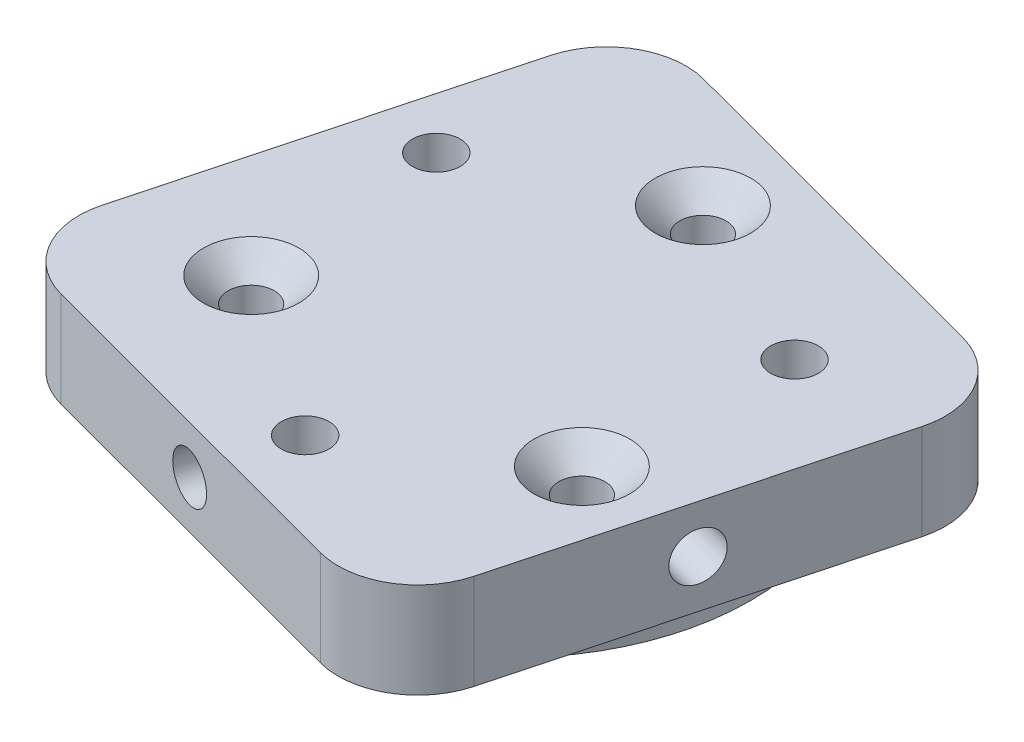
ISO-10303-21;
HEADER;
FILE_DESCRIPTION(('STEP AP214'),'2;1');
FILE_NAME('part.step','',(''),(''),'','','');
FILE_SCHEMA(('AUTOMOTIVE_DESIGN { 1 0 10303 214 1 1 1 1 }'));
ENDSEC;
DATA;
#1=APPLICATION_CONTEXT('core data for automotive mechanical design processes');
#2=APPLICATION_PROTOCOL_DEFINITION('international standard','automotive_design',2000,#1);
#3=PRODUCT_CONTEXT('',#1,'mechanical');
#4=PRODUCT('Part','Part','',(#3));
#5=PRODUCT_RELATED_PRODUCT_CATEGORY('part','',(#4));
#6=PRODUCT_DEFINITION_FORMATION('','',#4);
#7=PRODUCT_DEFINITION_CONTEXT('part definition',#1,'design');
#8=PRODUCT_DEFINITION('design','',#6,#7);
#9=PRODUCT_DEFINITION_SHAPE('','',#8);
#10=(LENGTH_UNIT() NAMED_UNIT(*) SI_UNIT(.MILLI.,.METRE.));
#11=(NAMED_UNIT(*) PLANE_ANGLE_UNIT() SI_UNIT($,.RADIAN.));
#12=(NAMED_UNIT(*) SI_UNIT($,.STERADIAN.) SOLID_ANGLE_UNIT());
#13=UNCERTAINTY_MEASURE_WITH_UNIT(LENGTH_MEASURE(1.E-05),#10,'distance_accuracy_value','');
#14=(GEOMETRIC_REPRESENTATION_CONTEXT(3) GLOBAL_UNCERTAINTY_ASSIGNED_CONTEXT((#13)) GLOBAL_UNIT_ASSIGNED_CONTEXT((#10,
#11,#12)) REPRESENTATION_CONTEXT('',''));
#15=CARTESIAN_POINT('',(0.,0.,0.));
#16=DIRECTION('',(0.,0.,1.));
#17=DIRECTION('',(1.,0.,0.));
#18=AXIS2_PLACEMENT_3D('',#15,#16,#17);
#19=CARTESIAN_POINT('',(22.5578744114501,5.,6.01617480152647));
#20=DIRECTION('',(-0.966227030545209,0.,-0.257692307692308));
#21=DIRECTION('',(-0.257692307692308,0.,0.96622703054521));
#22=AXIS2_PLACEMENT_3D('',#19,#20,#21);
#23=CYLINDRICAL_SURFACE('',#22,1.5);
#24=CARTESIAN_POINT('',(-15.942746003996,5.,-4.25192307692308));
#25=DIRECTION('',(-0.966227030545209,0.,-0.257692307692308));
#26=DIRECTION('',(-0.257692307692308,0.,0.966227030545209));
#27=AXIS2_PLACEMENT_3D('',#24,#25,#26);
#28=CIRCLE('',#27,1.5);
#29=CARTESIAN_POINT('',(-16.3292844655344,5.,-2.80258253110526));
#30=VERTEX_POINT('',#29);
#31=EDGE_CURVE('E233',#30,#30,#28,.T.);
#32=ORIENTED_EDGE('',*,*,#31,.T.);
#33=EDGE_LOOP('',(#32));
#34=FACE_BOUND('',#33,.T.);
#35=CARTESIAN_POINT('',(-0.0891901874349355,5.,-0.0237869822485182));
#36=DIRECTION('',(-0.8654416636931,0.,0.501009707235418));
#37=DIRECTION('',(-0.501009707235418,0.,-0.8654416636931));
#38=AXIS2_PLACEMENT_3D('',#35,#36,#37);
#39=ELLIPSE('',#38,2.12132034355964,1.5);
#40=CARTESIAN_POINT('',(-0.0891901874349355,3.5,-0.0237869822485182));
#41=VERTEX_POINT('',#40);
#42=CARTESIAN_POINT('',(-0.0891901874349355,6.5,-0.0237869822485182));
#43=VERTEX_POINT('',#42);
#44=EDGE_CURVE('E50',#41,#43,#39,.F.);
#45=ORIENTED_EDGE('',*,*,#44,.T.);
#46=CARTESIAN_POINT('',(-0.0891901874349355,5.,-0.0237869822485182));
#47=DIRECTION('',(-0.501009707235418,0.,-0.8654416636931));
#48=DIRECTION('',(-0.8654416636931,0.,0.501009707235418));
#49=AXIS2_PLACEMENT_3D('',#46,#47,#48);
#50=ELLIPSE('',#49,2.12132034355964,1.5);
#51=EDGE_CURVE('E11',#43,#41,#50,.F.);
#52=ORIENTED_EDGE('',*,*,#51,.T.);
#53=EDGE_LOOP('',(#45,#52));
#54=FACE_BOUND('',#53,.T.);
#55=ADVANCED_FACE('F36',(#34,#54),#23,.F.);
#56=CARTESIAN_POINT('',(0.,8.,0.));
#57=DIRECTION('',(0.,1.,0.));
#58=DIRECTION('',(0.,0.,1.));
#59=AXIS2_PLACEMENT_3D('',#56,#57,#58);
#60=PLANE('',#59);
#61=CARTESIAN_POINT('',(10.3923048454132,8.,6.00000000000005));
#62=DIRECTION('',(0.,1.,0.));
#63=DIRECTION('',(0.,0.,1.));
#64=AXIS2_PLACEMENT_3D('',#61,#62,#63);
#65=CIRCLE('',#64,3.00000000000001);
#66=CARTESIAN_POINT('',(10.3923048454132,8.,9.00000000000006));
#67=VERTEX_POINT('',#66);
#68=EDGE_CURVE('E222',#67,#67,#65,.F.);
#69=ORIENTED_EDGE('',*,*,#68,.T.);
#70=EDGE_LOOP('',(#69));
#71=FACE_BOUND('',#70,.T.);
#72=CARTESIAN_POINT('',(-10.3923048454133,8.,5.99999999999998));
#73=DIRECTION('',(0.,1.,0.));
#74=DIRECTION('',(0.,0.,1.));
#75=AXIS2_PLACEMENT_3D('',#72,#73,#74);
#76=CIRCLE('',#75,3.00000000000001);
#77=CARTESIAN_POINT('',(-10.3923048454133,8.,8.99999999999998));
#78=VERTEX_POINT('',#77);
#79=EDGE_CURVE('E219',#78,#78,#76,.F.);
#80=ORIENTED_EDGE('',*,*,#79,.T.);
#81=EDGE_LOOP('',(#80));
#82=FACE_BOUND('',#81,.T.);
#83=CARTESIAN_POINT('',(0.,8.,-12.));
#84=DIRECTION('',(0.,1.,0.));
#85=DIRECTION('',(0.,0.,1.));
#86=AXIS2_PLACEMENT_3D('',#83,#84,#85);
#87=CIRCLE('',#86,3.00000000000001);
#88=CARTESIAN_POINT('',(0.,8.,-8.99999999999999));
#89=VERTEX_POINT('',#88);
#90=EDGE_CURVE('E216',#89,#89,#87,.F.);
#91=ORIENTED_EDGE('',*,*,#90,.T.);
#92=EDGE_LOOP('',(#91));
#93=FACE_BOUND('',#92,.T.);
#94=CARTESIAN_POINT('',(0.,8.,13.));
#95=DIRECTION('',(0.,1.,0.));
#96=DIRECTION('',(0.,0.,1.));
#97=AXIS2_PLACEMENT_3D('',#94,#95,#96);
#98=CIRCLE('',#97,1.5);
#99=CARTESIAN_POINT('',(0.,8.,14.5));
#100=VERTEX_POINT('',#99);
#101=EDGE_CURVE('E190',#100,#100,#98,.T.);
#102=ORIENTED_EDGE('',*,*,#101,.F.);
#103=EDGE_LOOP('',(#102));
#104=FACE_BOUND('',#103,.T.);
#105=CARTESIAN_POINT('',(-11.2583302491977,8.,-6.49999999999997));
#106=DIRECTION('',(0.,1.,0.));
#107=DIRECTION('',(0.,0.,1.));
#108=AXIS2_PLACEMENT_3D('',#105,#106,#107);
#109=CIRCLE('',#108,1.5);
#110=CARTESIAN_POINT('',(-11.2583302491977,8.,-4.99999999999997));
#111=VERTEX_POINT('',#110);
#112=EDGE_CURVE('E196',#111,#111,#109,.T.);
#113=ORIENTED_EDGE('',*,*,#112,.F.);
#114=EDGE_LOOP('',(#113));
#115=FACE_BOUND('',#114,.T.);
#116=CARTESIAN_POINT('',(11.2583302491977,8.,-6.50000000000005));
#117=DIRECTION('',(0.,1.,0.));
#118=DIRECTION('',(0.,0.,1.));
#119=AXIS2_PLACEMENT_3D('',#116,#117,#118);
#120=CIRCLE('',#119,1.5);
#121=CARTESIAN_POINT('',(11.2583302491977,8.,-5.00000000000005));
#122=VERTEX_POINT('',#121);
#123=EDGE_CURVE('E184',#122,#122,#120,.T.);
#124=ORIENTED_EDGE('',*,*,#123,.F.);
#125=EDGE_LOOP('',(#124));
#126=FACE_BOUND('',#125,.T.);
#127=CARTESIAN_POINT('',(8.14814931280838,8.,14.0750723897315));
#128=DIRECTION('',(0.,1.,0.));
#129=DIRECTION('',(0.,0.,-1.));
#130=AXIS2_PLACEMENT_3D('',#127,#128,#129);
#131=CIRCLE('',#130,4.99999999999999);
#132=CARTESIAN_POINT('',(6.85968777434683,8.,18.9062075424575));
#133=VERTEX_POINT('',#132);
#134=CARTESIAN_POINT('',(12.9792844655344,8.,15.363533928193));
#135=VERTEX_POINT('',#134);
#136=EDGE_CURVE('E147',#133,#135,#131,.T.);
#137=ORIENTED_EDGE('',*,*,#136,.T.);
#138=DIRECTION('',(0.257692307692308,0.,-0.966227030545209));
#139=VECTOR('',#138,1.);
#140=CARTESIAN_POINT('',(18.9062075424575,8.,-6.85968777434685));
#141=LINE('',#140,#139);
#142=CARTESIAN_POINT('',(18.9062075424575,8.,-6.85968777434685));
#143=VERTEX_POINT('',#142);
#144=EDGE_CURVE('E150',#135,#143,#141,.T.);
#145=ORIENTED_EDGE('',*,*,#144,.T.);
#146=CARTESIAN_POINT('',(14.0750723897314,8.,-8.14814931280838));
#147=DIRECTION('',(0.,1.,0.));
#148=DIRECTION('',(0.,0.,-1.));
#149=AXIS2_PLACEMENT_3D('',#146,#147,#148);
#150=CIRCLE('',#149,5.);
#151=CARTESIAN_POINT('',(15.363533928193,8.,-12.9792844655344));
#152=VERTEX_POINT('',#151);
#153=EDGE_CURVE('E154',#143,#152,#150,.T.);
#154=ORIENTED_EDGE('',*,*,#153,.T.);
#155=DIRECTION('',(-0.966227030545209,0.,-0.257692307692308));
#156=VECTOR('',#155,1.);
#157=CARTESIAN_POINT('',(-6.85968777434684,8.,-18.9062075424575));
#158=LINE('',#157,#156);
#159=CARTESIAN_POINT('',(-6.85968777434684,8.,-18.9062075424575));
#160=VERTEX_POINT('',#159);
#161=EDGE_CURVE('E157',#152,#160,#158,.T.);
#162=ORIENTED_EDGE('',*,*,#161,.T.);
#163=CARTESIAN_POINT('',(-8.14814931280837,8.,-14.0750723897315));
#164=DIRECTION('',(0.,1.,0.));
#165=DIRECTION('',(0.,0.,-1.));
#166=AXIS2_PLACEMENT_3D('',#163,#164,#165);
#167=CIRCLE('',#166,5.);
#168=CARTESIAN_POINT('',(-12.9792844655344,8.,-15.363533928193));
#169=VERTEX_POINT('',#168);
#170=EDGE_CURVE('E160',#160,#169,#167,.T.);
#171=ORIENTED_EDGE('',*,*,#170,.T.);
#172=DIRECTION('',(-0.257692307692308,0.,0.966227030545209));
#173=VECTOR('',#172,1.);
#174=CARTESIAN_POINT('',(-12.9792844655344,8.,-15.363533928193));
#175=LINE('',#174,#173);
#176=CARTESIAN_POINT('',(-18.9062075424575,8.,6.85968777434684));
#177=VERTEX_POINT('',#176);
#178=EDGE_CURVE('E163',#169,#177,#175,.T.);
#179=ORIENTED_EDGE('',*,*,#178,.T.);
#180=CARTESIAN_POINT('',(-14.0750723897315,8.,8.14814931280838));
#181=DIRECTION('',(0.,1.,0.));
#182=DIRECTION('',(0.,0.,1.));
#183=AXIS2_PLACEMENT_3D('',#180,#181,#182);
#184=CIRCLE('',#183,5.);
#185=CARTESIAN_POINT('',(-15.363533928193,8.,12.9792844655344));
#186=VERTEX_POINT('',#185);
#187=EDGE_CURVE('E122',#177,#186,#184,.T.);
#188=ORIENTED_EDGE('',*,*,#187,.T.);
#189=DIRECTION('',(0.966227030545209,0.,0.257692307692308));
#190=VECTOR('',#189,1.);
#191=CARTESIAN_POINT('',(-15.363533928193,8.,12.9792844655344));
#192=LINE('',#191,#190);
#193=EDGE_CURVE('E166',#186,#133,#192,.T.);
#194=ORIENTED_EDGE('',*,*,#193,.T.);
#195=EDGE_LOOP('',(#137,#145,#154,#162,#171,#179,#188,#194));
#196=FACE_BOUND('',#195,.T.);
#197=ADVANCED_FACE('F248',(#71,#82,#93,#104,#115,#126,#196),#60,.T.);
#198=CARTESIAN_POINT('',(0.,0.,0.));
#199=DIRECTION('',(0.,1.,0.));
#200=DIRECTION('',(0.,0.,1.));
#201=AXIS2_PLACEMENT_3D('',#198,#199,#200);
#202=PLANE('',#201);
#203=CARTESIAN_POINT('',(0.,0.,0.));
#204=DIRECTION('',(0.,1.,0.));
#205=DIRECTION('',(0.,0.,1.));
#206=AXIS2_PLACEMENT_3D('',#203,#204,#205);
#207=CIRCLE('',#206,15.);
#208=CARTESIAN_POINT('',(0.,0.,15.));
#209=VERTEX_POINT('',#208);
#210=EDGE_CURVE('E210',#209,#209,#207,.T.);
#211=ORIENTED_EDGE('',*,*,#210,.F.);
#212=EDGE_LOOP('',(#211));
#213=FACE_BOUND('',#212,.T.);
#214=CARTESIAN_POINT('',(0.,0.,-12.));
#215=DIRECTION('',(0.,1.,0.));
#216=DIRECTION('',(0.,0.,1.));
#217=AXIS2_PLACEMENT_3D('',#214,#215,#216);
#218=CIRCLE('',#217,1.45);
#219=CARTESIAN_POINT('',(0.,0.,-10.55));
#220=VERTEX_POINT('',#219);
#221=EDGE_CURVE('E207',#220,#220,#218,.T.);
#222=ORIENTED_EDGE('',*,*,#221,.T.);
#223=EDGE_LOOP('',(#222));
#224=FACE_BOUND('',#223,.T.);
#225=CARTESIAN_POINT('',(-10.3923048454133,0.,5.99999999999998));
#226=DIRECTION('',(0.,1.,0.));
#227=DIRECTION('',(0.,0.,1.));
#228=AXIS2_PLACEMENT_3D('',#225,#226,#227);
#229=CIRCLE('',#228,1.45);
#230=CARTESIAN_POINT('',(-10.3923048454133,0.,7.44999999999998));
#231=VERTEX_POINT('',#230);
#232=EDGE_CURVE('E204',#231,#231,#229,.T.);
#233=ORIENTED_EDGE('',*,*,#232,.T.);
#234=EDGE_LOOP('',(#233));
#235=FACE_BOUND('',#234,.T.);
#236=CARTESIAN_POINT('',(10.3923048454132,0.,6.00000000000005));
#237=DIRECTION('',(0.,1.,0.));
#238=DIRECTION('',(0.,0.,1.));
#239=AXIS2_PLACEMENT_3D('',#236,#237,#238);
#240=CIRCLE('',#239,1.45);
#241=CARTESIAN_POINT('',(10.3923048454132,0.,7.45000000000005));
#242=VERTEX_POINT('',#241);
#243=EDGE_CURVE('E199',#242,#242,#240,.T.);
#244=ORIENTED_EDGE('',*,*,#243,.T.);
#245=EDGE_LOOP('',(#244));
#246=FACE_BOUND('',#245,.T.);
#247=CARTESIAN_POINT('',(-11.2583302491977,0.,-6.49999999999997));
#248=DIRECTION('',(0.,1.,0.));
#249=DIRECTION('',(0.,0.,1.));
#250=AXIS2_PLACEMENT_3D('',#247,#248,#249);
#251=CIRCLE('',#250,1.5);
#252=CARTESIAN_POINT('',(-11.2583302491977,0.,-4.99999999999997));
#253=VERTEX_POINT('',#252);
#254=EDGE_CURVE('E193',#253,#253,#251,.T.);
#255=ORIENTED_EDGE('',*,*,#254,.T.);
#256=EDGE_LOOP('',(#255));
#257=FACE_BOUND('',#256,.T.);
#258=CARTESIAN_POINT('',(0.,0.,13.));
#259=DIRECTION('',(0.,1.,0.));
#260=DIRECTION('',(0.,0.,1.));
#261=AXIS2_PLACEMENT_3D('',#258,#259,#260);
#262=CIRCLE('',#261,1.5);
#263=CARTESIAN_POINT('',(0.,0.,14.5));
#264=VERTEX_POINT('',#263);
#265=EDGE_CURVE('E187',#264,#264,#262,.T.);
#266=ORIENTED_EDGE('',*,*,#265,.T.);
#267=EDGE_LOOP('',(#266));
#268=FACE_BOUND('',#267,.T.);
#269=CARTESIAN_POINT('',(11.2583302491977,0.,-6.50000000000005));
#270=DIRECTION('',(0.,1.,0.));
#271=DIRECTION('',(0.,0.,1.));
#272=AXIS2_PLACEMENT_3D('',#269,#270,#271);
#273=CIRCLE('',#272,1.5);
#274=CARTESIAN_POINT('',(11.2583302491977,0.,-5.00000000000005));
#275=VERTEX_POINT('',#274);
#276=EDGE_CURVE('E183',#275,#275,#273,.T.);
#277=ORIENTED_EDGE('',*,*,#276,.T.);
#278=EDGE_LOOP('',(#277));
#279=FACE_BOUND('',#278,.T.);
#280=ADVANCED_FACE('F254',(#213,#224,#235,#246,#257,#268,#279),#202,.F.);
#281=CARTESIAN_POINT('',(0.,8.,0.));
#282=DIRECTION('',(0.,-1.,0.));
#283=DIRECTION('',(0.,0.,-1.));
#284=AXIS2_PLACEMENT_3D('',#281,#282,#283);
#285=CYLINDRICAL_SURFACE('',#284,15.);
#286=CARTESIAN_POINT('',(0.,2.,0.));
#287=DIRECTION('',(0.,-1.,0.));
#288=DIRECTION('',(0.,0.,-1.));
#289=AXIS2_PLACEMENT_3D('',#286,#287,#288);
#290=CIRCLE('',#289,15.);
#291=CARTESIAN_POINT('',(0.,2.,-15.));
#292=VERTEX_POINT('',#291);
#293=EDGE_CURVE('E171',#292,#292,#290,.T.);
#294=ORIENTED_EDGE('',*,*,#293,.T.);
#295=EDGE_LOOP('',(#294));
#296=FACE_BOUND('',#295,.T.);
#297=ORIENTED_EDGE('',*,*,#210,.T.);
#298=EDGE_LOOP('',(#297));
#299=FACE_BOUND('',#298,.T.);
#300=ADVANCED_FACE('F281',(#296,#299),#285,.T.);
#301=CARTESIAN_POINT('',(0.,8.,-12.));
#302=DIRECTION('',(0.,-1.,0.));
#303=DIRECTION('',(0.,0.,-1.));
#304=AXIS2_PLACEMENT_3D('',#301,#302,#303);
#305=CYLINDRICAL_SURFACE('',#304,1.45);
#306=CARTESIAN_POINT('',(0.,6.45,-12.));
#307=DIRECTION('',(0.,1.,0.));
#308=DIRECTION('',(0.,0.,1.));
#309=AXIS2_PLACEMENT_3D('',#306,#307,#308);
#310=CIRCLE('',#309,1.45);
#311=CARTESIAN_POINT('',(0.,6.45,-10.55));
#312=VERTEX_POINT('',#311);
#313=EDGE_CURVE('E228',#312,#312,#310,.T.);
#314=ORIENTED_EDGE('',*,*,#313,.T.);
#315=EDGE_LOOP('',(#314));
#316=FACE_BOUND('',#315,.T.);
#317=ORIENTED_EDGE('',*,*,#221,.F.);
#318=EDGE_LOOP('',(#317));
#319=FACE_BOUND('',#318,.T.);
#320=ADVANCED_FACE('F277',(#316,#319),#305,.F.);
#321=CARTESIAN_POINT('',(-10.3923048454133,8.,5.99999999999998));
#322=DIRECTION('',(0.,-1.,0.));
#323=DIRECTION('',(0.,0.,-1.));
#324=AXIS2_PLACEMENT_3D('',#321,#322,#323);
#325=CYLINDRICAL_SURFACE('',#324,1.45);
#326=CARTESIAN_POINT('',(-10.3923048454133,6.45,5.99999999999998));
#327=DIRECTION('',(0.,1.,0.));
#328=DIRECTION('',(0.,0.,1.));
#329=AXIS2_PLACEMENT_3D('',#326,#327,#328);
#330=CIRCLE('',#329,1.45);
#331=CARTESIAN_POINT('',(-10.3923048454133,6.45,7.44999999999998));
#332=VERTEX_POINT('',#331);
#333=EDGE_CURVE('E225',#332,#332,#330,.T.);
#334=ORIENTED_EDGE('',*,*,#333,.T.);
#335=EDGE_LOOP('',(#334));
#336=FACE_BOUND('',#335,.T.);
#337=ORIENTED_EDGE('',*,*,#232,.F.);
#338=EDGE_LOOP('',(#337));
#339=FACE_BOUND('',#338,.T.);
#340=ADVANCED_FACE('F280',(#336,#339),#325,.F.);
#341=CARTESIAN_POINT('',(10.3923048454132,8.,6.00000000000005));
#342=DIRECTION('',(0.,-1.,0.));
#343=DIRECTION('',(0.,0.,-1.));
#344=AXIS2_PLACEMENT_3D('',#341,#342,#343);
#345=CYLINDRICAL_SURFACE('',#344,1.45);
#346=CARTESIAN_POINT('',(10.3923048454132,6.45,6.00000000000005));
#347=DIRECTION('',(0.,1.,0.));
#348=DIRECTION('',(0.,0.,1.));
#349=AXIS2_PLACEMENT_3D('',#346,#347,#348);
#350=CIRCLE('',#349,1.45);
#351=CARTESIAN_POINT('',(10.3923048454132,6.45,7.45000000000005));
#352=VERTEX_POINT('',#351);
#353=EDGE_CURVE('E213',#352,#352,#350,.T.);
#354=ORIENTED_EDGE('',*,*,#353,.T.);
#355=EDGE_LOOP('',(#354));
#356=FACE_BOUND('',#355,.T.);
#357=ORIENTED_EDGE('',*,*,#243,.F.);
#358=EDGE_LOOP('',(#357));
#359=FACE_BOUND('',#358,.T.);
#360=ADVANCED_FACE('F354',(#356,#359),#345,.F.);
#361=CARTESIAN_POINT('',(-11.2583302491977,8.,-6.49999999999997));
#362=DIRECTION('',(0.,-1.,0.));
#363=DIRECTION('',(0.,0.,-1.));
#364=AXIS2_PLACEMENT_3D('',#361,#362,#363);
#365=CYLINDRICAL_SURFACE('',#364,1.5);
#366=ORIENTED_EDGE('',*,*,#254,.F.);
#367=EDGE_LOOP('',(#366));
#368=FACE_BOUND('',#367,.T.);
#369=ORIENTED_EDGE('',*,*,#112,.T.);
#370=EDGE_LOOP('',(#369));
#371=FACE_BOUND('',#370,.T.);
#372=ADVANCED_FACE('F350',(#368,#371),#365,.F.);
#373=CARTESIAN_POINT('',(0.,8.,13.));
#374=DIRECTION('',(0.,-1.,0.));
#375=DIRECTION('',(0.,0.,-1.));
#376=AXIS2_PLACEMENT_3D('',#373,#374,#375);
#377=CYLINDRICAL_SURFACE('',#376,1.5);
#378=ORIENTED_EDGE('',*,*,#265,.F.);
#379=EDGE_LOOP('',(#378));
#380=FACE_BOUND('',#379,.T.);
#381=ORIENTED_EDGE('',*,*,#101,.T.);
#382=EDGE_LOOP('',(#381));
#383=FACE_BOUND('',#382,.T.);
#384=ADVANCED_FACE('F302',(#380,#383),#377,.F.);
#385=CARTESIAN_POINT('',(11.2583302491977,8.,-6.50000000000005));
#386=DIRECTION('',(0.,-1.,0.));
#387=DIRECTION('',(0.,0.,-1.));
#388=AXIS2_PLACEMENT_3D('',#385,#386,#387);
#389=CYLINDRICAL_SURFACE('',#388,1.5);
#390=ORIENTED_EDGE('',*,*,#276,.F.);
#391=EDGE_LOOP('',(#390));
#392=FACE_BOUND('',#391,.T.);
#393=ORIENTED_EDGE('',*,*,#123,.T.);
#394=EDGE_LOOP('',(#393));
#395=FACE_BOUND('',#394,.T.);
#396=ADVANCED_FACE('F299',(#392,#395),#389,.F.);
#397=CARTESIAN_POINT('',(8.14814931280838,2.,14.0750723897315));
#398=DIRECTION('',(0.,-1.,0.));
#399=DIRECTION('',(0.,0.,-1.));
#400=AXIS2_PLACEMENT_3D('',#397,#398,#399);
#401=PLANE('',#400);
#402=CARTESIAN_POINT('',(8.14814931280838,2.,14.0750723897315));
#403=DIRECTION('',(0.,1.,0.));
#404=DIRECTION('',(0.,0.,-1.));
#405=AXIS2_PLACEMENT_3D('',#402,#403,#404);
#406=CIRCLE('',#405,4.99999999999999);
#407=CARTESIAN_POINT('',(6.85968777434683,2.,18.9062075424575));
#408=VERTEX_POINT('',#407);
#409=CARTESIAN_POINT('',(12.9792844655344,2.,15.363533928193));
#410=VERTEX_POINT('',#409);
#411=EDGE_CURVE('E169',#408,#410,#406,.T.);
#412=ORIENTED_EDGE('',*,*,#411,.F.);
#413=DIRECTION('',(0.966227030545209,0.,0.257692307692308));
#414=VECTOR('',#413,1.);
#415=CARTESIAN_POINT('',(-15.363533928193,2.,12.9792844655344));
#416=LINE('',#415,#414);
#417=CARTESIAN_POINT('',(-15.363533928193,2.,12.9792844655344));
#418=VERTEX_POINT('',#417);
#419=EDGE_CURVE('E137',#418,#408,#416,.T.);
#420=ORIENTED_EDGE('',*,*,#419,.F.);
#421=CARTESIAN_POINT('',(-14.0750723897315,2.,8.14814931280838));
#422=DIRECTION('',(0.,1.,0.));
#423=DIRECTION('',(0.,0.,1.));
#424=AXIS2_PLACEMENT_3D('',#421,#422,#423);
#425=CIRCLE('',#424,5.);
#426=CARTESIAN_POINT('',(-18.9062075424575,2.,6.85968777434684));
#427=VERTEX_POINT('',#426);
#428=EDGE_CURVE('E119',#427,#418,#425,.T.);
#429=ORIENTED_EDGE('',*,*,#428,.F.);
#430=DIRECTION('',(-0.257692307692308,0.,0.966227030545209));
#431=VECTOR('',#430,1.);
#432=CARTESIAN_POINT('',(-12.9792844655344,2.,-15.363533928193));
#433=LINE('',#432,#431);
#434=CARTESIAN_POINT('',(-12.9792844655344,2.,-15.363533928193));
#435=VERTEX_POINT('',#434);
#436=EDGE_CURVE('E135',#435,#427,#433,.T.);
#437=ORIENTED_EDGE('',*,*,#436,.F.);
#438=CARTESIAN_POINT('',(-8.14814931280837,2.,-14.0750723897315));
#439=DIRECTION('',(0.,1.,0.));
#440=DIRECTION('',(0.,0.,-1.));
#441=AXIS2_PLACEMENT_3D('',#438,#439,#440);
#442=CIRCLE('',#441,5.);
#443=CARTESIAN_POINT('',(-6.85968777434684,2.,-18.9062075424575));
#444=VERTEX_POINT('',#443);
#445=EDGE_CURVE('E140',#444,#435,#442,.T.);
#446=ORIENTED_EDGE('',*,*,#445,.F.);
#447=DIRECTION('',(-0.966227030545209,0.,-0.257692307692308));
#448=VECTOR('',#447,1.);
#449=CARTESIAN_POINT('',(-6.85968777434684,2.,-18.9062075424575));
#450=LINE('',#449,#448);
#451=CARTESIAN_POINT('',(15.363533928193,2.,-12.9792844655344));
#452=VERTEX_POINT('',#451);
#453=EDGE_CURVE('E142',#452,#444,#450,.T.);
#454=ORIENTED_EDGE('',*,*,#453,.F.);
#455=CARTESIAN_POINT('',(14.0750723897314,2.,-8.14814931280838));
#456=DIRECTION('',(0.,1.,0.));
#457=DIRECTION('',(0.,0.,-1.));
#458=AXIS2_PLACEMENT_3D('',#455,#456,#457);
#459=CIRCLE('',#458,5.);
#460=CARTESIAN_POINT('',(18.9062075424575,2.,-6.85968777434685));
#461=VERTEX_POINT('',#460);
#462=EDGE_CURVE('E464',#461,#452,#459,.T.);
#463=ORIENTED_EDGE('',*,*,#462,.F.);
#464=DIRECTION('',(0.257692307692308,0.,-0.966227030545209));
#465=VECTOR('',#464,1.);
#466=CARTESIAN_POINT('',(18.9062075424575,2.,-6.85968777434685));
#467=LINE('',#466,#465);
#468=EDGE_CURVE('E310',#410,#461,#467,.T.);
#469=ORIENTED_EDGE('',*,*,#468,.F.);
#470=EDGE_LOOP('',(#412,#420,#429,#437,#446,#454,#463,#469));
#471=FACE_BOUND('',#470,.T.);
#472=ORIENTED_EDGE('',*,*,#293,.F.);
#473=EDGE_LOOP('',(#472));
#474=FACE_BOUND('',#473,.T.);
#475=ADVANCED_FACE('F132',(#471,#474),#401,.T.);
#476=CARTESIAN_POINT('',(8.14814931280838,2.,14.0750723897315));
#477=DIRECTION('',(0.,1.,0.));
#478=DIRECTION('',(0.,0.,1.));
#479=AXIS2_PLACEMENT_3D('',#476,#477,#478);
#480=CYLINDRICAL_SURFACE('',#479,4.99999999999999);
#481=ORIENTED_EDGE('',*,*,#136,.F.);
#482=DIRECTION('',(0.,1.,0.));
#483=VECTOR('',#482,1.);
#484=CARTESIAN_POINT('',(6.85968777434683,2.,18.9062075424575));
#485=LINE('',#484,#483);
#486=EDGE_CURVE('E59',#408,#133,#485,.T.);
#487=ORIENTED_EDGE('',*,*,#486,.F.);
#488=ORIENTED_EDGE('',*,*,#411,.T.);
#489=DIRECTION('',(0.,1.,0.));
#490=VECTOR('',#489,1.);
#491=CARTESIAN_POINT('',(12.9792844655344,2.,15.363533928193));
#492=LINE('',#491,#490);
#493=EDGE_CURVE('E98',#410,#135,#492,.T.);
#494=ORIENTED_EDGE('',*,*,#493,.T.);
#495=EDGE_LOOP('',(#481,#487,#488,#494));
#496=FACE_BOUND('',#495,.T.);
#497=ADVANCED_FACE('F307',(#496),#480,.T.);
#498=CARTESIAN_POINT('',(-15.363533928193,2.,12.9792844655344));
#499=DIRECTION('',(-0.257692307692308,0.,0.966227030545209));
#500=DIRECTION('',(0.96622703054521,0.,0.257692307692308));
#501=AXIS2_PLACEMENT_3D('',#498,#499,#500);
#502=PLANE('',#501);
#503=CARTESIAN_POINT('',(-4.34111326435802,5.,15.9189590217474));
#504=DIRECTION('',(-0.257692307692308,0.,0.966227030545209));
#505=DIRECTION('',(0.96622703054521,0.,0.257692307692308));
#506=AXIS2_PLACEMENT_3D('',#503,#504,#505);
#507=CIRCLE('',#506,1.5);
#508=CARTESIAN_POINT('',(-2.8917727185402,5.,16.3054974832859));
#509=VERTEX_POINT('',#508);
#510=EDGE_CURVE('E455',#509,#509,#507,.T.);
#511=ORIENTED_EDGE('',*,*,#510,.F.);
#512=EDGE_LOOP('',(#511));
#513=FACE_BOUND('',#512,.T.);
#514=ORIENTED_EDGE('',*,*,#193,.F.);
#515=DIRECTION('',(0.,1.,0.));
#516=VECTOR('',#515,1.);
#517=CARTESIAN_POINT('',(-15.363533928193,2.,12.9792844655344));
#518=LINE('',#517,#516);
#519=EDGE_CURVE('E127',#418,#186,#518,.T.);
#520=ORIENTED_EDGE('',*,*,#519,.F.);
#521=ORIENTED_EDGE('',*,*,#419,.T.);
#522=ORIENTED_EDGE('',*,*,#486,.T.);
#523=EDGE_LOOP('',(#514,#520,#521,#522));
#524=FACE_BOUND('',#523,.T.);
#525=ADVANCED_FACE('F323',(#513,#524),#502,.T.);
#526=CARTESIAN_POINT('',(-14.0750723897315,2.,8.14814931280838));
#527=DIRECTION('',(0.,1.,0.));
#528=DIRECTION('',(0.,0.,1.));
#529=AXIS2_PLACEMENT_3D('',#526,#527,#528);
#530=CYLINDRICAL_SURFACE('',#529,5.);
#531=ORIENTED_EDGE('',*,*,#187,.F.);
#532=DIRECTION('',(0.,1.,0.));
#533=VECTOR('',#532,1.);
#534=CARTESIAN_POINT('',(-18.9062075424575,2.,6.85968777434684));
#535=LINE('',#534,#533);
#536=EDGE_CURVE('E116',#427,#177,#535,.T.);
#537=ORIENTED_EDGE('',*,*,#536,.F.);
#538=ORIENTED_EDGE('',*,*,#428,.T.);
#539=ORIENTED_EDGE('',*,*,#519,.T.);
#540=EDGE_LOOP('',(#531,#537,#538,#539));
#541=FACE_BOUND('',#540,.T.);
#542=ADVANCED_FACE('F118',(#541),#530,.T.);
#543=CARTESIAN_POINT('',(-12.9792844655344,2.,-15.363533928193));
#544=DIRECTION('',(-0.966227030545209,0.,-0.257692307692308));
#545=DIRECTION('',(-0.257692307692308,0.,0.966227030545209));
#546=AXIS2_PLACEMENT_3D('',#543,#544,#545);
#547=PLANE('',#546);
#548=ORIENTED_EDGE('',*,*,#31,.F.);
#549=EDGE_LOOP('',(#548));
#550=FACE_BOUND('',#549,.T.);
#551=ORIENTED_EDGE('',*,*,#178,.F.);
#552=DIRECTION('',(0.,1.,0.));
#553=VECTOR('',#552,1.);
#554=CARTESIAN_POINT('',(-12.9792844655344,2.,-15.363533928193));
#555=LINE('',#554,#553);
#556=EDGE_CURVE('E128',#435,#169,#555,.T.);
#557=ORIENTED_EDGE('',*,*,#556,.F.);
#558=ORIENTED_EDGE('',*,*,#436,.T.);
#559=ORIENTED_EDGE('',*,*,#536,.T.);
#560=EDGE_LOOP('',(#551,#557,#558,#559));
#561=FACE_BOUND('',#560,.T.);
#562=ADVANCED_FACE('F139',(#550,#561),#547,.T.);
#563=CARTESIAN_POINT('',(-8.14814931280837,2.,-14.0750723897315));
#564=DIRECTION('',(0.,1.,0.));
#565=DIRECTION('',(0.,0.,1.));
#566=AXIS2_PLACEMENT_3D('',#563,#564,#565);
#567=CYLINDRICAL_SURFACE('',#566,5.);
#568=ORIENTED_EDGE('',*,*,#170,.F.);
#569=DIRECTION('',(0.,1.,0.));
#570=VECTOR('',#569,1.);
#571=CARTESIAN_POINT('',(-6.85968777434684,2.,-18.9062075424575));
#572=LINE('',#571,#570);
#573=EDGE_CURVE('E174',#444,#160,#572,.T.);
#574=ORIENTED_EDGE('',*,*,#573,.F.);
#575=ORIENTED_EDGE('',*,*,#445,.T.);
#576=ORIENTED_EDGE('',*,*,#556,.T.);
#577=EDGE_LOOP('',(#568,#574,#575,#576));
#578=FACE_BOUND('',#577,.T.);
#579=ADVANCED_FACE('F322',(#578),#567,.T.);
#580=CARTESIAN_POINT('',(-6.85968777434684,2.,-18.9062075424575));
#581=DIRECTION('',(0.257692307692308,0.,-0.966227030545209));
#582=DIRECTION('',(-0.96622703054521,0.,-0.257692307692308));
#583=AXIS2_PLACEMENT_3D('',#580,#581,#582);
#584=PLANE('',#583);
#585=CARTESIAN_POINT('',(4.16273288948815,5.,-15.9665329862445));
#586=DIRECTION('',(0.257692307692308,0.,-0.966227030545209));
#587=DIRECTION('',(-0.966227030545209,0.,-0.257692307692308));
#588=AXIS2_PLACEMENT_3D('',#585,#586,#587);
#589=CIRCLE('',#588,1.5);
#590=CARTESIAN_POINT('',(2.71339234367033,5.,-16.353071447783));
#591=VERTEX_POINT('',#590);
#592=EDGE_CURVE('E456',#591,#591,#589,.T.);
#593=ORIENTED_EDGE('',*,*,#592,.F.);
#594=EDGE_LOOP('',(#593));
#595=FACE_BOUND('',#594,.T.);
#596=ORIENTED_EDGE('',*,*,#161,.F.);
#597=DIRECTION('',(0.,1.,0.));
#598=VECTOR('',#597,1.);
#599=CARTESIAN_POINT('',(15.363533928193,2.,-12.9792844655344));
#600=LINE('',#599,#598);
#601=EDGE_CURVE('E176',#452,#152,#600,.T.);
#602=ORIENTED_EDGE('',*,*,#601,.F.);
#603=ORIENTED_EDGE('',*,*,#453,.T.);
#604=ORIENTED_EDGE('',*,*,#573,.T.);
#605=EDGE_LOOP('',(#596,#602,#603,#604));
#606=FACE_BOUND('',#605,.T.);
#607=ADVANCED_FACE('F318',(#595,#606),#584,.T.);
#608=CARTESIAN_POINT('',(14.0750723897314,2.,-8.14814931280838));
#609=DIRECTION('',(0.,1.,0.));
#610=DIRECTION('',(0.,0.,1.));
#611=AXIS2_PLACEMENT_3D('',#608,#609,#610);
#612=CYLINDRICAL_SURFACE('',#611,5.);
#613=ORIENTED_EDGE('',*,*,#153,.F.);
#614=DIRECTION('',(0.,1.,0.));
#615=VECTOR('',#614,1.);
#616=CARTESIAN_POINT('',(18.9062075424575,2.,-6.85968777434685));
#617=LINE('',#616,#615);
#618=EDGE_CURVE('E178',#461,#143,#617,.T.);
#619=ORIENTED_EDGE('',*,*,#618,.F.);
#620=ORIENTED_EDGE('',*,*,#462,.T.);
#621=ORIENTED_EDGE('',*,*,#601,.T.);
#622=EDGE_LOOP('',(#613,#619,#620,#621));
#623=FACE_BOUND('',#622,.T.);
#624=ADVANCED_FACE('F314',(#623),#612,.T.);
#625=CARTESIAN_POINT('',(18.9062075424575,2.,-6.85968777434685));
#626=DIRECTION('',(0.966227030545209,0.,0.257692307692308));
#627=DIRECTION('',(0.257692307692308,0.,-0.966227030545209));
#628=AXIS2_PLACEMENT_3D('',#625,#626,#627);
#629=PLANE('',#628);
#630=CARTESIAN_POINT('',(15.9427460039959,5.,4.25192307692308));
#631=DIRECTION('',(0.966227030545209,0.,0.257692307692308));
#632=DIRECTION('',(0.257692307692308,0.,-0.966227030545209));
#633=AXIS2_PLACEMENT_3D('',#630,#631,#632);
#634=CIRCLE('',#633,1.5);
#635=CARTESIAN_POINT('',(16.3292844655344,5.,2.80258253110526));
#636=VERTEX_POINT('',#635);
#637=EDGE_CURVE('E151',#636,#636,#634,.T.);
#638=ORIENTED_EDGE('',*,*,#637,.F.);
#639=EDGE_LOOP('',(#638));
#640=FACE_BOUND('',#639,.T.);
#641=ORIENTED_EDGE('',*,*,#144,.F.);
#642=ORIENTED_EDGE('',*,*,#493,.F.);
#643=ORIENTED_EDGE('',*,*,#468,.T.);
#644=ORIENTED_EDGE('',*,*,#618,.T.);
#645=EDGE_LOOP('',(#641,#642,#643,#644));
#646=FACE_BOUND('',#645,.T.);
#647=ADVANCED_FACE('F308',(#640,#646),#629,.T.);
#648=CARTESIAN_POINT('',(10.3923048454132,6.45,6.00000000000005));
#649=DIRECTION('',(0.,1.,0.));
#650=DIRECTION('',(0.,0.,1.));
#651=AXIS2_PLACEMENT_3D('',#648,#649,#650);
#652=CONICAL_SURFACE('',#651,1.45,0.785398163397451);
#653=ORIENTED_EDGE('',*,*,#68,.F.);
#654=EDGE_LOOP('',(#653));
#655=FACE_BOUND('',#654,.T.);
#656=ORIENTED_EDGE('',*,*,#353,.F.);
#657=EDGE_LOOP('',(#656));
#658=FACE_BOUND('',#657,.T.);
#659=ADVANCED_FACE('F271',(#655,#658),#652,.F.);
#660=CARTESIAN_POINT('',(-10.3923048454133,6.45,5.99999999999998));
#661=DIRECTION('',(0.,1.,0.));
#662=DIRECTION('',(0.,0.,1.));
#663=AXIS2_PLACEMENT_3D('',#660,#661,#662);
#664=CONICAL_SURFACE('',#663,1.45,0.785398163397451);
#665=ORIENTED_EDGE('',*,*,#79,.F.);
#666=EDGE_LOOP('',(#665));
#667=FACE_BOUND('',#666,.T.);
#668=ORIENTED_EDGE('',*,*,#333,.F.);
#669=EDGE_LOOP('',(#668));
#670=FACE_BOUND('',#669,.T.);
#671=ADVANCED_FACE('F266',(#667,#670),#664,.F.);
#672=CARTESIAN_POINT('',(0.,6.45,-12.));
#673=DIRECTION('',(0.,1.,0.));
#674=DIRECTION('',(0.,0.,1.));
#675=AXIS2_PLACEMENT_3D('',#672,#673,#674);
#676=CONICAL_SURFACE('',#675,1.45,0.785398163397451);
#677=ORIENTED_EDGE('',*,*,#90,.F.);
#678=EDGE_LOOP('',(#677));
#679=FACE_BOUND('',#678,.T.);
#680=ORIENTED_EDGE('',*,*,#313,.F.);
#681=EDGE_LOOP('',(#680));
#682=FACE_BOUND('',#681,.T.);
#683=ADVANCED_FACE('F39',(#679,#682),#676,.F.);
#684=CARTESIAN_POINT('',(-0.0891901874349355,5.,-0.0237869822485182));
#685=DIRECTION('',(-0.8654416636931,0.,0.501009707235418));
#686=DIRECTION('',(-0.501009707235418,0.,-0.8654416636931));
#687=AXIS2_PLACEMENT_3D('',#684,#685,#686);
#688=ELLIPSE('',#687,2.12132034355964,1.5);
#689=EDGE_CURVE('E235',#41,#43,#688,.T.);
#690=ORIENTED_EDGE('',*,*,#689,.T.);
#691=CARTESIAN_POINT('',(-0.0891901874349355,5.,-0.0237869822485182));
#692=DIRECTION('',(-0.501009707235418,0.,-0.8654416636931));
#693=DIRECTION('',(-0.8654416636931,0.,0.501009707235418));
#694=AXIS2_PLACEMENT_3D('',#691,#692,#693);
#695=ELLIPSE('',#694,2.12132034355964,1.5);
#696=EDGE_CURVE('E45',#43,#41,#695,.T.);
#697=ORIENTED_EDGE('',*,*,#696,.T.);
#698=EDGE_LOOP('',(#690,#697));
#699=FACE_BOUND('',#698,.T.);
#700=ORIENTED_EDGE('',*,*,#637,.T.);
#701=EDGE_LOOP('',(#700));
#702=FACE_BOUND('',#701,.T.);
#703=ADVANCED_FACE('F239',(#699,#702),#23,.F.);
#704=CARTESIAN_POINT('',(-6.1053649889614,5.,22.5340874292016));
#705=DIRECTION('',(0.257692307692308,0.,-0.966227030545209));
#706=DIRECTION('',(-0.966227030545209,0.,-0.257692307692308));
#707=AXIS2_PLACEMENT_3D('',#704,#705,#706);
#708=CYLINDRICAL_SURFACE('',#707,1.5);
#709=ORIENTED_EDGE('',*,*,#592,.T.);
#710=EDGE_LOOP('',(#709));
#711=FACE_BOUND('',#710,.T.);
#712=ORIENTED_EDGE('',*,*,#44,.F.);
#713=ORIENTED_EDGE('',*,*,#696,.F.);
#714=EDGE_LOOP('',(#712,#713));
#715=FACE_BOUND('',#714,.T.);
#716=ADVANCED_FACE('F244',(#711,#715),#708,.F.);
#717=ORIENTED_EDGE('',*,*,#510,.T.);
#718=EDGE_LOOP('',(#717));
#719=FACE_BOUND('',#718,.T.);
#720=ORIENTED_EDGE('',*,*,#689,.F.);
#721=ORIENTED_EDGE('',*,*,#51,.F.);
#722=EDGE_LOOP('',(#720,#721));
#723=FACE_BOUND('',#722,.T.);
#724=ADVANCED_FACE('F246',(#719,#723),#708,.F.);
#725=CLOSED_SHELL('',(#55,#197,#280,#300,#320,#340,#360,#372,#384,#396,#475,#497,#525,#542,#562,
#579,#607,#624,#647,#659,#671,#683,#703,#716,#724));
#726=MANIFOLD_SOLID_BREP('B2',#725);
#727=ADVANCED_BREP_SHAPE_REPRESENTATION('',(#18,#726),#14);
#728=SHAPE_DEFINITION_REPRESENTATION(#9,#727);
ENDSEC;
END-ISO-10303-21;
